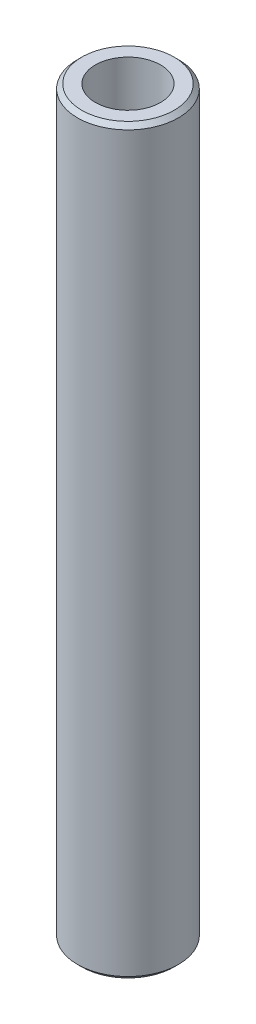
ISO-10303-21;
HEADER;
FILE_DESCRIPTION(('STEP AP214'),'2;1');
FILE_NAME('part.step','',(''),(''),'','','');
FILE_SCHEMA(('AUTOMOTIVE_DESIGN { 1 0 10303 214 1 1 1 1 }'));
ENDSEC;
DATA;
#1=APPLICATION_CONTEXT('core data for automotive mechanical design processes');
#2=APPLICATION_PROTOCOL_DEFINITION('international standard','automotive_design',2000,#1);
#3=PRODUCT_CONTEXT('',#1,'mechanical');
#4=PRODUCT('Part','Part','',(#3));
#5=PRODUCT_RELATED_PRODUCT_CATEGORY('part','',(#4));
#6=PRODUCT_DEFINITION_FORMATION('','',#4);
#7=PRODUCT_DEFINITION_CONTEXT('part definition',#1,'design');
#8=PRODUCT_DEFINITION('design','',#6,#7);
#9=PRODUCT_DEFINITION_SHAPE('','',#8);
#10=(LENGTH_UNIT() NAMED_UNIT(*) SI_UNIT(.MILLI.,.METRE.));
#11=(NAMED_UNIT(*) PLANE_ANGLE_UNIT() SI_UNIT($,.RADIAN.));
#12=(NAMED_UNIT(*) SI_UNIT($,.STERADIAN.) SOLID_ANGLE_UNIT());
#13=UNCERTAINTY_MEASURE_WITH_UNIT(LENGTH_MEASURE(1.E-05),#10,'distance_accuracy_value','');
#14=(GEOMETRIC_REPRESENTATION_CONTEXT(3) GLOBAL_UNCERTAINTY_ASSIGNED_CONTEXT((#13)) GLOBAL_UNIT_ASSIGNED_CONTEXT((#10,
#11,#12)) REPRESENTATION_CONTEXT('',''));
#15=CARTESIAN_POINT('',(0.,0.,0.));
#16=DIRECTION('',(0.,0.,1.));
#17=DIRECTION('',(1.,0.,0.));
#18=AXIS2_PLACEMENT_3D('',#15,#16,#17);
#19=CARTESIAN_POINT('',(0.,550.941150437474,0.));
#20=DIRECTION('',(0.,-1.,0.));
#21=DIRECTION('',(0.,0.,-1.));
#22=AXIS2_PLACEMENT_3D('',#19,#20,#21);
#23=CYLINDRICAL_SURFACE('',#22,37.5);
#24=CARTESIAN_POINT('',(0.,547.714920970529,0.));
#25=DIRECTION('',(0.,1.,0.));
#26=DIRECTION('',(0.,0.,1.));
#27=AXIS2_PLACEMENT_3D('',#24,#25,#26);
#28=CIRCLE('',#27,37.5);
#29=CARTESIAN_POINT('',(0.,547.714920970529,37.5));
#30=VERTEX_POINT('',#29);
#31=EDGE_CURVE('E50',#30,#30,#28,.F.);
#32=ORIENTED_EDGE('',*,*,#31,.T.);
#33=EDGE_LOOP('',(#32));
#34=FACE_BOUND('',#33,.T.);
#35=CARTESIAN_POINT('',(0.,3.22622946694484,0.));
#36=DIRECTION('',(0.,1.,0.));
#37=DIRECTION('',(0.,0.,1.));
#38=AXIS2_PLACEMENT_3D('',#35,#36,#37);
#39=CIRCLE('',#38,37.5);
#40=CARTESIAN_POINT('',(0.,3.22622946694484,37.5));
#41=VERTEX_POINT('',#40);
#42=EDGE_CURVE('E51',#41,#41,#39,.T.);
#43=ORIENTED_EDGE('',*,*,#42,.T.);
#44=EDGE_LOOP('',(#43));
#45=FACE_BOUND('',#44,.T.);
#46=ADVANCED_FACE('F39',(#34,#45),#23,.T.);
#47=CARTESIAN_POINT('',(0.,550.941150437474,0.));
#48=DIRECTION('',(0.,1.,0.));
#49=DIRECTION('',(0.,0.,1.));
#50=AXIS2_PLACEMENT_3D('',#47,#48,#49);
#51=PLANE('',#50);
#52=CARTESIAN_POINT('',(0.,550.941150437474,0.));
#53=DIRECTION('',(0.,1.,0.));
#54=DIRECTION('',(0.,0.,1.));
#55=AXIS2_PLACEMENT_3D('',#52,#53,#54);
#56=CIRCLE('',#55,34.2737705330548);
#57=CARTESIAN_POINT('',(0.,550.941150437474,34.2737705330548));
#58=VERTEX_POINT('',#57);
#59=EDGE_CURVE('E54',#58,#58,#56,.T.);
#60=ORIENTED_EDGE('',*,*,#59,.T.);
#61=EDGE_LOOP('',(#60));
#62=FACE_BOUND('',#61,.T.);
#63=CARTESIAN_POINT('',(0.,550.941150437474,0.));
#64=DIRECTION('',(0.,1.,0.));
#65=DIRECTION('',(0.,0.,1.));
#66=AXIS2_PLACEMENT_3D('',#63,#64,#65);
#67=CIRCLE('',#66,24.2160476797552);
#68=CARTESIAN_POINT('',(0.,550.941150437474,24.2160476797552));
#69=VERTEX_POINT('',#68);
#70=EDGE_CURVE('E58',#69,#69,#67,.T.);
#71=ORIENTED_EDGE('',*,*,#70,.F.);
#72=EDGE_LOOP('',(#71));
#73=FACE_BOUND('',#72,.T.);
#74=ADVANCED_FACE('F69',(#62,#73),#51,.T.);
#75=CARTESIAN_POINT('',(0.,0.,0.));
#76=DIRECTION('',(0.,1.,0.));
#77=DIRECTION('',(0.,0.,1.));
#78=AXIS2_PLACEMENT_3D('',#75,#76,#77);
#79=PLANE('',#78);
#80=CARTESIAN_POINT('',(0.,0.,0.));
#81=DIRECTION('',(0.,1.,0.));
#82=DIRECTION('',(0.,0.,1.));
#83=AXIS2_PLACEMENT_3D('',#80,#81,#82);
#84=CIRCLE('',#83,34.2737705330551);
#85=CARTESIAN_POINT('',(0.,0.,34.2737705330551));
#86=VERTEX_POINT('',#85);
#87=EDGE_CURVE('E10',#86,#86,#84,.F.);
#88=ORIENTED_EDGE('',*,*,#87,.T.);
#89=EDGE_LOOP('',(#88));
#90=FACE_BOUND('',#89,.T.);
#91=CARTESIAN_POINT('',(0.,0.,0.));
#92=DIRECTION('',(0.,1.,0.));
#93=DIRECTION('',(0.,0.,1.));
#94=AXIS2_PLACEMENT_3D('',#91,#92,#93);
#95=CIRCLE('',#94,24.2160476797552);
#96=CARTESIAN_POINT('',(0.,0.,24.2160476797552));
#97=VERTEX_POINT('',#96);
#98=EDGE_CURVE('E63',#97,#97,#95,.T.);
#99=ORIENTED_EDGE('',*,*,#98,.T.);
#100=EDGE_LOOP('',(#99));
#101=FACE_BOUND('',#100,.T.);
#102=ADVANCED_FACE('F75',(#90,#101),#79,.F.);
#103=CARTESIAN_POINT('',(0.,550.941150437474,0.));
#104=DIRECTION('',(0.,-1.,0.));
#105=DIRECTION('',(0.,0.,-1.));
#106=AXIS2_PLACEMENT_3D('',#103,#104,#105);
#107=CYLINDRICAL_SURFACE('',#106,24.2160476797552);
#108=ORIENTED_EDGE('',*,*,#70,.T.);
#109=EDGE_LOOP('',(#108));
#110=FACE_BOUND('',#109,.T.);
#111=ORIENTED_EDGE('',*,*,#98,.F.);
#112=EDGE_LOOP('',(#111));
#113=FACE_BOUND('',#112,.T.);
#114=ADVANCED_FACE('F70',(#110,#113),#107,.F.);
#115=CARTESIAN_POINT('',(0.,550.941150437474,0.));
#116=DIRECTION('',(0.,-1.,0.));
#117=DIRECTION('',(0.,0.,-1.));
#118=AXIS2_PLACEMENT_3D('',#115,#116,#117);
#119=CONICAL_SURFACE('',#118,34.2737705330548,0.785398163397452);
#120=ORIENTED_EDGE('',*,*,#31,.F.);
#121=EDGE_LOOP('',(#120));
#122=FACE_BOUND('',#121,.T.);
#123=ORIENTED_EDGE('',*,*,#59,.F.);
#124=EDGE_LOOP('',(#123));
#125=FACE_BOUND('',#124,.T.);
#126=ADVANCED_FACE('F81',(#122,#125),#119,.T.);
#127=CARTESIAN_POINT('',(0.,3.22622946694484,0.));
#128=DIRECTION('',(0.,1.,0.));
#129=DIRECTION('',(0.,0.,1.));
#130=AXIS2_PLACEMENT_3D('',#127,#128,#129);
#131=CONICAL_SURFACE('',#130,37.5,0.785398163397452);
#132=CARTESIAN_POINT('',(0.,0.,34.2737705330551));
#133=CARTESIAN_POINT('',(0.,0.0336065569473397,34.3073770900025));
#134=CARTESIAN_POINT('',(0.,0.0672131138946825,34.3409836469498));
#135=CARTESIAN_POINT('',(0.,0.134426227789368,34.4081967608445));
#136=CARTESIAN_POINT('',(0.,0.168032784736711,34.4418033177919));
#137=CARTESIAN_POINT('',(0.,0.235245898631395,34.5090164316865));
#138=CARTESIAN_POINT('',(0.,0.268852455578736,34.5426229886339));
#139=CARTESIAN_POINT('',(0.,0.33606556947342,34.6098361025286));
#140=CARTESIAN_POINT('',(0.,0.369672126420763,34.6434426594759));
#141=CARTESIAN_POINT('',(0.,0.436885240315448,34.7106557733706));
#142=CARTESIAN_POINT('',(0.,0.470491797262789,34.7442623303179));
#143=CARTESIAN_POINT('',(0.,0.537704911157473,34.8114754442126));
#144=CARTESIAN_POINT('',(0.,0.571311468104814,34.84508200116));
#145=CARTESIAN_POINT('',(0.,0.638524581999499,34.9122951150546));
#146=CARTESIAN_POINT('',(0.,0.672131138946842,34.945901672002));
#147=CARTESIAN_POINT('',(0.,0.739344252841526,35.0131147858967));
#148=CARTESIAN_POINT('',(0.,0.772950809788868,35.046721342844));
#149=CARTESIAN_POINT('',(0.,0.840163923683552,35.1139344567387));
#150=CARTESIAN_POINT('',(0.,0.873770480630893,35.147541013686));
#151=CARTESIAN_POINT('',(0.,0.940983594525578,35.2147541275807));
#152=CARTESIAN_POINT('',(0.,0.974590151472921,35.2483606845281));
#153=CARTESIAN_POINT('',(0.,1.04180326536761,35.3155737984227));
#154=CARTESIAN_POINT('',(0.,1.07540982231495,35.3491803553701));
#155=CARTESIAN_POINT('',(0.,1.14262293620963,35.4163934692648));
#156=CARTESIAN_POINT('',(0.,1.17622949315697,35.4500000262121));
#157=CARTESIAN_POINT('',(0.,1.24344260705166,35.5172131401068));
#158=CARTESIAN_POINT('',(0.,1.277049163999,35.5508196970541));
#159=CARTESIAN_POINT('',(0.,1.34426227789368,35.6180328109488));
#160=CARTESIAN_POINT('',(0.,1.37786883484102,35.6516393678962));
#161=CARTESIAN_POINT('',(0.,1.44508194873571,35.7188524817909));
#162=CARTESIAN_POINT('',(0.,1.47868850568305,35.7524590387382));
#163=CARTESIAN_POINT('',(0.,1.54590161957774,35.8196721526329));
#164=CARTESIAN_POINT('',(0.,1.57950817652508,35.8532787095802));
#165=CARTESIAN_POINT('',(0.,1.64672129041976,35.9204918234749));
#166=CARTESIAN_POINT('',(0.,1.6803278473671,35.9540983804223));
#167=CARTESIAN_POINT('',(0.,1.74754096126179,36.0213114943169));
#168=CARTESIAN_POINT('',(0.,1.78114751820913,36.0549180512643));
#169=CARTESIAN_POINT('',(0.,1.84836063210382,36.122131165159));
#170=CARTESIAN_POINT('',(0.,1.88196718905116,36.1557377221063));
#171=CARTESIAN_POINT('',(0.,1.94918030294584,36.222950836001));
#172=CARTESIAN_POINT('',(0.,1.98278685989318,36.2565573929483));
#173=CARTESIAN_POINT('',(0.,2.04999997378787,36.323770506843));
#174=CARTESIAN_POINT('',(0.,2.08360653073521,36.3573770637904));
#175=CARTESIAN_POINT('',(0.,2.15081964462989,36.424590177685));
#176=CARTESIAN_POINT('',(0.,2.18442620157724,36.4581967346324));
#177=CARTESIAN_POINT('',(0.,2.25163931547192,36.5254098485271));
#178=CARTESIAN_POINT('',(0.,2.28524587241926,36.5590164054744));
#179=CARTESIAN_POINT('',(0.,2.35245898631395,36.6262295193691));
#180=CARTESIAN_POINT('',(0.,2.38606554326129,36.6598360763164));
#181=CARTESIAN_POINT('',(0.,2.45327865715597,36.7270491902111));
#182=CARTESIAN_POINT('',(0.,2.48688521410331,36.7606557471585));
#183=CARTESIAN_POINT('',(0.,2.554098327998,36.8278688610532));
#184=CARTESIAN_POINT('',(0.,2.58770488494534,36.8614754180005));
#185=CARTESIAN_POINT('',(0.,2.65491799884003,36.9286885318952));
#186=CARTESIAN_POINT('',(0.,2.68852455578737,36.9622950888425));
#187=CARTESIAN_POINT('',(0.,2.75573766968205,37.0295082027372));
#188=CARTESIAN_POINT('',(0.,2.78934422662939,37.0631147596846));
#189=CARTESIAN_POINT('',(0.,2.85655734052408,37.1303278735792));
#190=CARTESIAN_POINT('',(0.,2.89016389747142,37.1639344305266));
#191=CARTESIAN_POINT('',(0.,2.9573770113661,37.2311475444213));
#192=CARTESIAN_POINT('',(0.,2.99098356831345,37.2647541013686));
#193=CARTESIAN_POINT('',(0.,3.05819668220813,37.3319672152633));
#194=CARTESIAN_POINT('',(0.,3.09180323915547,37.3655737722106));
#195=CARTESIAN_POINT('',(0.,3.15901635305016,37.4327868861053));
#196=CARTESIAN_POINT('',(0.,3.1926229099975,37.4663934430527));
#197=CARTESIAN_POINT('',(0.,3.22622946694484,37.5));
#198=B_SPLINE_CURVE_WITH_KNOTS('',3,(#132,#133,#134,#135,#136,#137,#138,#139,#140,#141,#142,
#143,#144,#145,#146,#147,#148,#149,#150,#151,#152,#153,#154,#155,#156,#157,#158,#159,#160,#161,
#162,#163,#164,#165,#166,#167,#168,#169,#170,#171,#172,#173,#174,#175,#176,#177,#178,#179,#180,
#181,#182,#183,#184,#185,#186,#187,#188,#189,#190,#191,#192,#193,#194,#195,#196,#197),
.UNSPECIFIED.,.F.,.F.,(4,2,2,2,2,2,2,2,2,2,2,2,2,2,2,2,2,2,2,2,2,2,2,2,2,2,2,2,2,2,2,2,4),(0.,
0.142580545858787,0.28516109171757,0.427741637576357,0.570322183435139,0.712902729293927,
0.855483275152714,0.998063821011496,1.14064436687028,1.28322491272907,1.42580545858785,
1.56838600444664,1.71096655030542,1.85354709616421,1.996127642023,2.13870818788178,
2.28128873374057,2.42386927959935,2.56644982545814,2.70903037131692,2.85161091717571,
2.99419146303449,3.13677200889328,3.27935255475206,3.42193310061085,3.56451364646964,
3.70709419232842,3.84967473818721,3.99225528404599,4.13483582990478,4.27741637576356,
4.41999692162235,4.56257746748114),.UNSPECIFIED.);
#199=EDGE_CURVE('BSEAM45',#86,#41,#198,.T.);
#200=ORIENTED_EDGE('',*,*,#87,.F.);
#201=ORIENTED_EDGE('',*,*,#42,.F.);
#202=ORIENTED_EDGE('',*,*,#199,.T.);
#203=ORIENTED_EDGE('',*,*,#199,.F.);
#204=EDGE_LOOP('',(#200,#202,#201,#203));
#205=FACE_BOUND('',#204,.T.);
#206=ADVANCED_FACE('F45',(#205),#131,.T.);
#207=CLOSED_SHELL('',(#46,#74,#102,#114,#126,#206));
#208=MANIFOLD_SOLID_BREP('B2',#207);
#209=ADVANCED_BREP_SHAPE_REPRESENTATION('',(#18,#208),#14);
#210=SHAPE_DEFINITION_REPRESENTATION(#9,#209);
ENDSEC;
END-ISO-10303-21;
